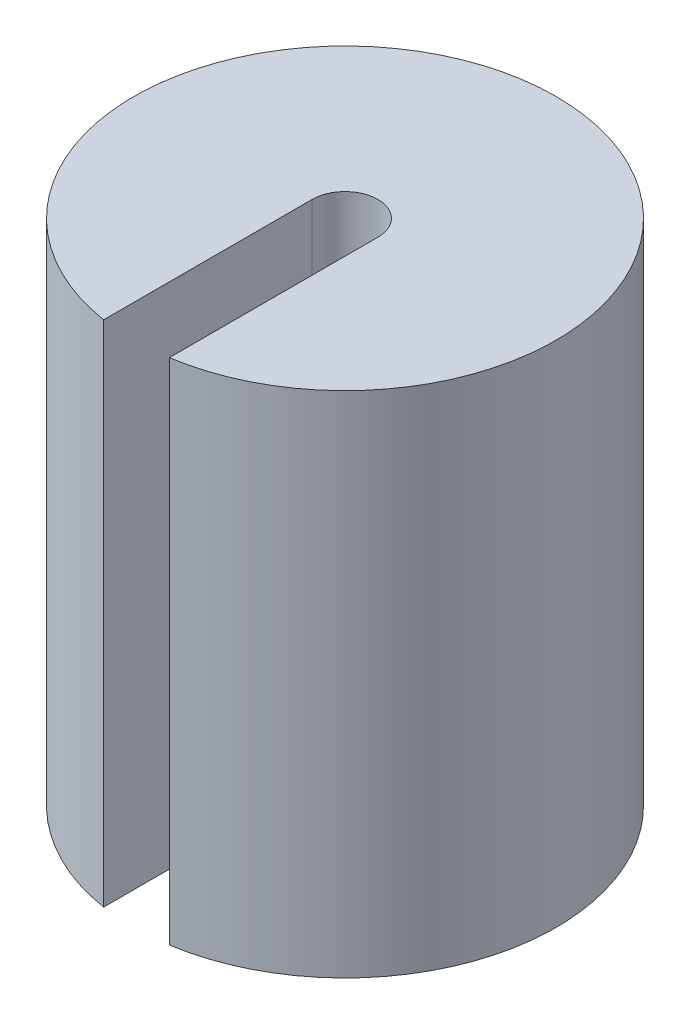
ISO-10303-21;
HEADER;
FILE_DESCRIPTION(('STEP AP214'),'2;1');
FILE_NAME('part.step','',(''),(''),'','','');
FILE_SCHEMA(('AUTOMOTIVE_DESIGN { 1 0 10303 214 1 1 1 1 }'));
ENDSEC;
DATA;
#1=APPLICATION_CONTEXT('core data for automotive mechanical design processes');
#2=APPLICATION_PROTOCOL_DEFINITION('international standard','automotive_design',2000,#1);
#3=PRODUCT_CONTEXT('',#1,'mechanical');
#4=PRODUCT('Part','Part','',(#3));
#5=PRODUCT_RELATED_PRODUCT_CATEGORY('part','',(#4));
#6=PRODUCT_DEFINITION_FORMATION('','',#4);
#7=PRODUCT_DEFINITION_CONTEXT('part definition',#1,'design');
#8=PRODUCT_DEFINITION('design','',#6,#7);
#9=PRODUCT_DEFINITION_SHAPE('','',#8);
#10=(LENGTH_UNIT() NAMED_UNIT(*) SI_UNIT(.MILLI.,.METRE.));
#11=(NAMED_UNIT(*) PLANE_ANGLE_UNIT() SI_UNIT($,.RADIAN.));
#12=(NAMED_UNIT(*) SI_UNIT($,.STERADIAN.) SOLID_ANGLE_UNIT());
#13=UNCERTAINTY_MEASURE_WITH_UNIT(LENGTH_MEASURE(1.E-05),#10,'distance_accuracy_value','');
#14=(GEOMETRIC_REPRESENTATION_CONTEXT(3) GLOBAL_UNCERTAINTY_ASSIGNED_CONTEXT((#13)) GLOBAL_UNIT_ASSIGNED_CONTEXT((#10,
#11,#12)) REPRESENTATION_CONTEXT('',''));
#15=CARTESIAN_POINT('',(0.,0.,0.));
#16=DIRECTION('',(0.,0.,1.));
#17=DIRECTION('',(1.,0.,0.));
#18=AXIS2_PLACEMENT_3D('',#15,#16,#17);
#19=CARTESIAN_POINT('',(0.,50.,0.));
#20=DIRECTION('',(0.,-1.,0.));
#21=DIRECTION('',(0.,0.,-1.));
#22=AXIS2_PLACEMENT_3D('',#19,#20,#21);
#23=CYLINDRICAL_SURFACE('',#22,20.75);
#24=CARTESIAN_POINT('',(0.,50.,0.));
#25=DIRECTION('',(0.,1.,0.));
#26=DIRECTION('',(0.,0.,1.));
#27=AXIS2_PLACEMENT_3D('',#24,#25,#26);
#28=CIRCLE('',#27,20.75);
#29=CARTESIAN_POINT('',(3.225,50.,20.4978504970643));
#30=VERTEX_POINT('',#29);
#31=CARTESIAN_POINT('',(-3.225,50.,20.4978504970643));
#32=VERTEX_POINT('',#31);
#33=EDGE_CURVE('E101',#30,#32,#28,.T.);
#34=ORIENTED_EDGE('',*,*,#33,.F.);
#35=DIRECTION('',(0.,-1.,0.));
#36=VECTOR('',#35,1.);
#37=CARTESIAN_POINT('',(3.225,50.,20.4978504970643));
#38=LINE('',#37,#36);
#39=CARTESIAN_POINT('',(3.225,0.,20.4978504970643));
#40=VERTEX_POINT('',#39);
#41=EDGE_CURVE('E107',#30,#40,#38,.T.);
#42=ORIENTED_EDGE('',*,*,#41,.T.);
#43=CARTESIAN_POINT('',(0.,0.,0.));
#44=DIRECTION('',(0.,1.,0.));
#45=DIRECTION('',(0.,0.,1.));
#46=AXIS2_PLACEMENT_3D('',#43,#44,#45);
#47=CIRCLE('',#46,20.75);
#48=CARTESIAN_POINT('',(-3.225,0.,20.4978504970643));
#49=VERTEX_POINT('',#48);
#50=EDGE_CURVE('E109',#40,#49,#47,.T.);
#51=ORIENTED_EDGE('',*,*,#50,.T.);
#52=DIRECTION('',(0.,-1.,0.));
#53=VECTOR('',#52,1.);
#54=CARTESIAN_POINT('',(-3.225,50.,20.4978504970643));
#55=LINE('',#54,#53);
#56=EDGE_CURVE('E57',#49,#32,#55,.F.);
#57=ORIENTED_EDGE('',*,*,#56,.T.);
#58=EDGE_LOOP('',(#34,#42,#51,#57));
#59=FACE_BOUND('',#58,.T.);
#60=ADVANCED_FACE('F43',(#59),#23,.T.);
#61=CARTESIAN_POINT('',(0.,50.,0.));
#62=DIRECTION('',(0.,1.,0.));
#63=DIRECTION('',(0.,0.,1.));
#64=AXIS2_PLACEMENT_3D('',#61,#62,#63);
#65=PLANE('',#64);
#66=DIRECTION('',(0.,0.,-1.));
#67=VECTOR('',#66,1.);
#68=CARTESIAN_POINT('',(3.225,50.,0.));
#69=LINE('',#68,#67);
#70=CARTESIAN_POINT('',(3.225,50.,0.));
#71=VERTEX_POINT('',#70);
#72=EDGE_CURVE('E89',#30,#71,#69,.T.);
#73=ORIENTED_EDGE('',*,*,#72,.F.);
#74=ORIENTED_EDGE('',*,*,#33,.T.);
#75=DIRECTION('',(0.,0.,1.));
#76=VECTOR('',#75,1.);
#77=CARTESIAN_POINT('',(-3.225,50.,0.));
#78=LINE('',#77,#76);
#79=CARTESIAN_POINT('',(-3.225,50.,0.));
#80=VERTEX_POINT('',#79);
#81=EDGE_CURVE('E84',#80,#32,#78,.T.);
#82=ORIENTED_EDGE('',*,*,#81,.F.);
#83=CARTESIAN_POINT('',(0.,50.,0.));
#84=DIRECTION('',(0.,1.,0.));
#85=DIRECTION('',(0.,0.,1.));
#86=AXIS2_PLACEMENT_3D('',#83,#84,#85);
#87=CIRCLE('',#86,3.225);
#88=EDGE_CURVE('E92',#71,#80,#87,.T.);
#89=ORIENTED_EDGE('',*,*,#88,.F.);
#90=EDGE_LOOP('',(#73,#74,#82,#89));
#91=FACE_BOUND('',#90,.T.);
#92=ADVANCED_FACE('F99',(#91),#65,.T.);
#93=CARTESIAN_POINT('',(0.,0.,0.));
#94=DIRECTION('',(0.,1.,0.));
#95=DIRECTION('',(0.,0.,1.));
#96=AXIS2_PLACEMENT_3D('',#93,#94,#95);
#97=PLANE('',#96);
#98=ORIENTED_EDGE('',*,*,#50,.F.);
#99=DIRECTION('',(0.,0.,-1.));
#100=VECTOR('',#99,1.);
#101=CARTESIAN_POINT('',(3.225,0.,0.));
#102=LINE('',#101,#100);
#103=CARTESIAN_POINT('',(3.225,0.,0.));
#104=VERTEX_POINT('',#103);
#105=EDGE_CURVE('E11',#40,#104,#102,.T.);
#106=ORIENTED_EDGE('',*,*,#105,.T.);
#107=CARTESIAN_POINT('',(0.,0.,0.));
#108=DIRECTION('',(0.,1.,0.));
#109=DIRECTION('',(0.,0.,1.));
#110=AXIS2_PLACEMENT_3D('',#107,#108,#109);
#111=CIRCLE('',#110,3.225);
#112=CARTESIAN_POINT('',(-3.225,0.,0.));
#113=VERTEX_POINT('',#112);
#114=EDGE_CURVE('E50',#104,#113,#111,.T.);
#115=ORIENTED_EDGE('',*,*,#114,.T.);
#116=DIRECTION('',(0.,0.,1.));
#117=VECTOR('',#116,1.);
#118=CARTESIAN_POINT('',(-3.225,0.,0.));
#119=LINE('',#118,#117);
#120=EDGE_CURVE('E85',#113,#49,#119,.T.);
#121=ORIENTED_EDGE('',*,*,#120,.T.);
#122=EDGE_LOOP('',(#98,#106,#115,#121));
#123=FACE_BOUND('',#122,.T.);
#124=ADVANCED_FACE('F115',(#123),#97,.F.);
#125=CARTESIAN_POINT('',(0.,-10.6,0.));
#126=DIRECTION('',(0.,1.,0.));
#127=DIRECTION('',(0.,0.,1.));
#128=AXIS2_PLACEMENT_3D('',#125,#126,#127);
#129=CYLINDRICAL_SURFACE('',#128,3.225);
#130=DIRECTION('',(0.,1.,0.));
#131=VECTOR('',#130,1.);
#132=CARTESIAN_POINT('',(3.225,-10.6,0.));
#133=LINE('',#132,#131);
#134=EDGE_CURVE('E88',#104,#71,#133,.T.);
#135=ORIENTED_EDGE('',*,*,#134,.T.);
#136=ORIENTED_EDGE('',*,*,#88,.T.);
#137=DIRECTION('',(0.,1.,0.));
#138=VECTOR('',#137,1.);
#139=CARTESIAN_POINT('',(-3.225,-10.6,0.));
#140=LINE('',#139,#138);
#141=EDGE_CURVE('E80',#113,#80,#140,.T.);
#142=ORIENTED_EDGE('',*,*,#141,.F.);
#143=ORIENTED_EDGE('',*,*,#114,.F.);
#144=EDGE_LOOP('',(#135,#136,#142,#143));
#145=FACE_BOUND('',#144,.T.);
#146=ADVANCED_FACE('F93',(#145),#129,.F.);
#147=CARTESIAN_POINT('',(3.225,-10.6,0.));
#148=DIRECTION('',(1.,0.,0.));
#149=DIRECTION('',(0.,0.,-1.));
#150=AXIS2_PLACEMENT_3D('',#147,#148,#149);
#151=PLANE('',#150);
#152=ORIENTED_EDGE('',*,*,#72,.T.);
#153=ORIENTED_EDGE('',*,*,#134,.F.);
#154=ORIENTED_EDGE('',*,*,#105,.F.);
#155=ORIENTED_EDGE('',*,*,#41,.F.);
#156=EDGE_LOOP('',(#152,#153,#154,#155));
#157=FACE_BOUND('',#156,.T.);
#158=ADVANCED_FACE('F116',(#157),#151,.F.);
#159=CARTESIAN_POINT('',(-3.225,-10.6,0.));
#160=DIRECTION('',(-1.,0.,0.));
#161=DIRECTION('',(0.,0.,1.));
#162=AXIS2_PLACEMENT_3D('',#159,#160,#161);
#163=PLANE('',#162);
#164=ORIENTED_EDGE('',*,*,#120,.F.);
#165=ORIENTED_EDGE('',*,*,#141,.T.);
#166=ORIENTED_EDGE('',*,*,#81,.T.);
#167=ORIENTED_EDGE('',*,*,#56,.F.);
#168=EDGE_LOOP('',(#164,#165,#166,#167));
#169=FACE_BOUND('',#168,.T.);
#170=ADVANCED_FACE('F82',(#169),#163,.F.);
#171=CLOSED_SHELL('',(#60,#92,#124,#146,#158,#170));
#172=MANIFOLD_SOLID_BREP('B2',#171);
#173=ADVANCED_BREP_SHAPE_REPRESENTATION('',(#18,#172),#14);
#174=SHAPE_DEFINITION_REPRESENTATION(#9,#173);
ENDSEC;
END-ISO-10303-21;
